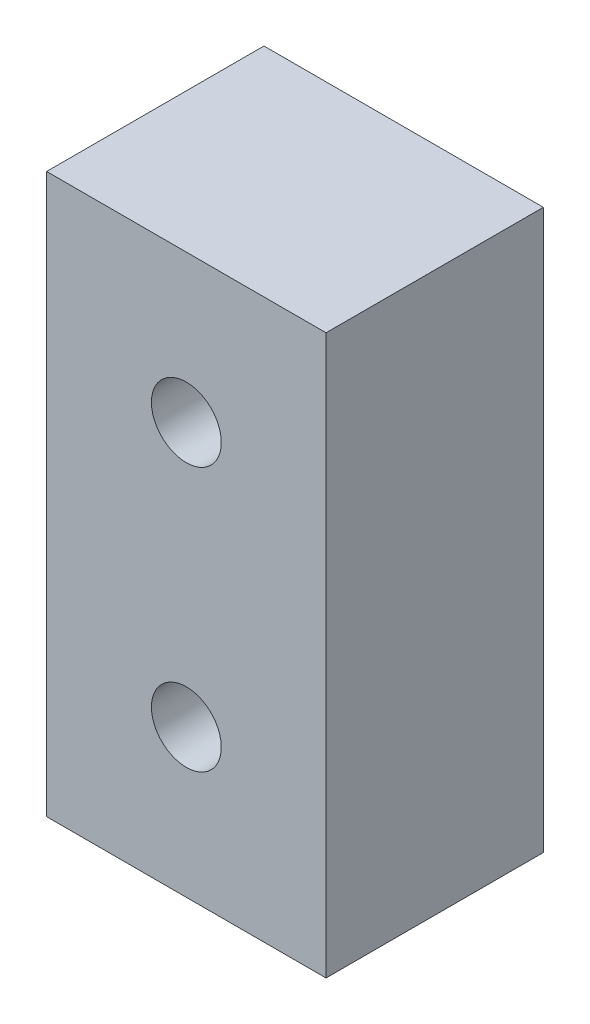
ISO-10303-21;
HEADER;
FILE_DESCRIPTION(('STEP AP214'),'2;1');
FILE_NAME('part.step','',(''),(''),'','','');
FILE_SCHEMA(('AUTOMOTIVE_DESIGN { 1 0 10303 214 1 1 1 1 }'));
ENDSEC;
DATA;
#1=APPLICATION_CONTEXT('core data for automotive mechanical design processes');
#2=APPLICATION_PROTOCOL_DEFINITION('international standard','automotive_design',2000,#1);
#3=PRODUCT_CONTEXT('',#1,'mechanical');
#4=PRODUCT('Part','Part','',(#3));
#5=PRODUCT_RELATED_PRODUCT_CATEGORY('part','',(#4));
#6=PRODUCT_DEFINITION_FORMATION('','',#4);
#7=PRODUCT_DEFINITION_CONTEXT('part definition',#1,'design');
#8=PRODUCT_DEFINITION('design','',#6,#7);
#9=PRODUCT_DEFINITION_SHAPE('','',#8);
#10=(LENGTH_UNIT() NAMED_UNIT(*) SI_UNIT(.MILLI.,.METRE.));
#11=(NAMED_UNIT(*) PLANE_ANGLE_UNIT() SI_UNIT($,.RADIAN.));
#12=(NAMED_UNIT(*) SI_UNIT($,.STERADIAN.) SOLID_ANGLE_UNIT());
#13=UNCERTAINTY_MEASURE_WITH_UNIT(LENGTH_MEASURE(1.E-05),#10,'distance_accuracy_value','');
#14=(GEOMETRIC_REPRESENTATION_CONTEXT(3) GLOBAL_UNCERTAINTY_ASSIGNED_CONTEXT((#13)) GLOBAL_UNIT_ASSIGNED_CONTEXT((#10,
#11,#12)) REPRESENTATION_CONTEXT('',''));
#15=CARTESIAN_POINT('',(0.,0.,0.));
#16=DIRECTION('',(0.,0.,1.));
#17=DIRECTION('',(1.,0.,0.));
#18=AXIS2_PLACEMENT_3D('',#15,#16,#17);
#19=CARTESIAN_POINT('',(-9.,-18.,7.));
#20=DIRECTION('',(1.,0.,0.));
#21=DIRECTION('',(0.,0.,-1.));
#22=AXIS2_PLACEMENT_3D('',#19,#20,#21);
#23=PLANE('',#22);
#24=DIRECTION('',(0.,-1.,0.));
#25=VECTOR('',#24,1.);
#26=CARTESIAN_POINT('',(-9.,-18.,-7.));
#27=LINE('',#26,#25);
#28=CARTESIAN_POINT('',(-9.,18.,-7.));
#29=VERTEX_POINT('',#28);
#30=CARTESIAN_POINT('',(-9.,-18.,-7.));
#31=VERTEX_POINT('',#30);
#32=EDGE_CURVE('E96',#29,#31,#27,.T.);
#33=ORIENTED_EDGE('',*,*,#32,.T.);
#34=DIRECTION('',(0.,0.,-1.));
#35=VECTOR('',#34,1.);
#36=CARTESIAN_POINT('',(-9.,-18.,7.));
#37=LINE('',#36,#35);
#38=CARTESIAN_POINT('',(-9.,-18.,7.));
#39=VERTEX_POINT('',#38);
#40=EDGE_CURVE('E11',#39,#31,#37,.T.);
#41=ORIENTED_EDGE('',*,*,#40,.F.);
#42=DIRECTION('',(0.,-1.,0.));
#43=VECTOR('',#42,1.);
#44=CARTESIAN_POINT('',(-9.,-18.,7.));
#45=LINE('',#44,#43);
#46=CARTESIAN_POINT('',(-9.,18.,7.));
#47=VERTEX_POINT('',#46);
#48=EDGE_CURVE('E84',#47,#39,#45,.T.);
#49=ORIENTED_EDGE('',*,*,#48,.F.);
#50=DIRECTION('',(0.,0.,-1.));
#51=VECTOR('',#50,1.);
#52=CARTESIAN_POINT('',(-9.,18.,7.));
#53=LINE('',#52,#51);
#54=EDGE_CURVE('E92',#47,#29,#53,.T.);
#55=ORIENTED_EDGE('',*,*,#54,.T.);
#56=EDGE_LOOP('',(#33,#41,#49,#55));
#57=FACE_BOUND('',#56,.T.);
#58=ADVANCED_FACE('F33',(#57),#23,.F.);
#59=CARTESIAN_POINT('',(9.,-18.,7.));
#60=DIRECTION('',(0.,1.,0.));
#61=DIRECTION('',(0.,0.,1.));
#62=AXIS2_PLACEMENT_3D('',#59,#60,#61);
#63=PLANE('',#62);
#64=DIRECTION('',(1.,0.,0.));
#65=VECTOR('',#64,1.);
#66=CARTESIAN_POINT('',(9.,-18.,-7.));
#67=LINE('',#66,#65);
#68=CARTESIAN_POINT('',(9.,-18.,-7.));
#69=VERTEX_POINT('',#68);
#70=EDGE_CURVE('E88',#31,#69,#67,.T.);
#71=ORIENTED_EDGE('',*,*,#70,.T.);
#72=DIRECTION('',(0.,0.,-1.));
#73=VECTOR('',#72,1.);
#74=CARTESIAN_POINT('',(9.,-18.,7.));
#75=LINE('',#74,#73);
#76=CARTESIAN_POINT('',(9.,-18.,7.));
#77=VERTEX_POINT('',#76);
#78=EDGE_CURVE('E41',#77,#69,#75,.T.);
#79=ORIENTED_EDGE('',*,*,#78,.F.);
#80=DIRECTION('',(1.,0.,0.));
#81=VECTOR('',#80,1.);
#82=CARTESIAN_POINT('',(9.,-18.,7.));
#83=LINE('',#82,#81);
#84=EDGE_CURVE('E79',#39,#77,#83,.T.);
#85=ORIENTED_EDGE('',*,*,#84,.F.);
#86=ORIENTED_EDGE('',*,*,#40,.T.);
#87=EDGE_LOOP('',(#71,#79,#85,#86));
#88=FACE_BOUND('',#87,.T.);
#89=ADVANCED_FACE('F87',(#88),#63,.F.);
#90=CARTESIAN_POINT('',(9.,-18.,7.));
#91=DIRECTION('',(-1.,0.,0.));
#92=DIRECTION('',(0.,0.,1.));
#93=AXIS2_PLACEMENT_3D('',#90,#91,#92);
#94=PLANE('',#93);
#95=DIRECTION('',(0.,1.,0.));
#96=VECTOR('',#95,1.);
#97=CARTESIAN_POINT('',(9.,-18.,-7.));
#98=LINE('',#97,#96);
#99=CARTESIAN_POINT('',(9.,18.,-7.));
#100=VERTEX_POINT('',#99);
#101=EDGE_CURVE('E66',#69,#100,#98,.T.);
#102=ORIENTED_EDGE('',*,*,#101,.T.);
#103=DIRECTION('',(0.,0.,-1.));
#104=VECTOR('',#103,1.);
#105=CARTESIAN_POINT('',(9.,18.,7.));
#106=LINE('',#105,#104);
#107=CARTESIAN_POINT('',(9.,18.,7.));
#108=VERTEX_POINT('',#107);
#109=EDGE_CURVE('E89',#108,#100,#106,.T.);
#110=ORIENTED_EDGE('',*,*,#109,.F.);
#111=DIRECTION('',(0.,1.,0.));
#112=VECTOR('',#111,1.);
#113=CARTESIAN_POINT('',(9.,-18.,7.));
#114=LINE('',#113,#112);
#115=EDGE_CURVE('E82',#77,#108,#114,.T.);
#116=ORIENTED_EDGE('',*,*,#115,.F.);
#117=ORIENTED_EDGE('',*,*,#78,.T.);
#118=EDGE_LOOP('',(#102,#110,#116,#117));
#119=FACE_BOUND('',#118,.T.);
#120=ADVANCED_FACE('F90',(#119),#94,.F.);
#121=CARTESIAN_POINT('',(9.,18.,7.));
#122=DIRECTION('',(0.,-1.,0.));
#123=DIRECTION('',(0.,0.,-1.));
#124=AXIS2_PLACEMENT_3D('',#121,#122,#123);
#125=PLANE('',#124);
#126=DIRECTION('',(-1.,0.,0.));
#127=VECTOR('',#126,1.);
#128=CARTESIAN_POINT('',(9.,18.,-7.));
#129=LINE('',#128,#127);
#130=EDGE_CURVE('E72',#100,#29,#129,.T.);
#131=ORIENTED_EDGE('',*,*,#130,.T.);
#132=ORIENTED_EDGE('',*,*,#54,.F.);
#133=DIRECTION('',(-1.,0.,0.));
#134=VECTOR('',#133,1.);
#135=CARTESIAN_POINT('',(9.,18.,7.));
#136=LINE('',#135,#134);
#137=EDGE_CURVE('E49',#108,#47,#136,.T.);
#138=ORIENTED_EDGE('',*,*,#137,.F.);
#139=ORIENTED_EDGE('',*,*,#109,.T.);
#140=EDGE_LOOP('',(#131,#132,#138,#139));
#141=FACE_BOUND('',#140,.T.);
#142=ADVANCED_FACE('F104',(#141),#125,.F.);
#143=CARTESIAN_POINT('',(0.,0.,7.));
#144=DIRECTION('',(0.,0.,1.));
#145=DIRECTION('',(1.,0.,0.));
#146=AXIS2_PLACEMENT_3D('',#143,#144,#145);
#147=PLANE('',#146);
#148=CARTESIAN_POINT('',(0.,8.5,7.));
#149=DIRECTION('',(0.,0.,-1.));
#150=DIRECTION('',(-1.,0.,0.));
#151=AXIS2_PLACEMENT_3D('',#148,#149,#150);
#152=CIRCLE('',#151,2.25);
#153=CARTESIAN_POINT('',(-2.25,8.5,7.));
#154=VERTEX_POINT('',#153);
#155=EDGE_CURVE('E121',#154,#154,#152,.T.);
#156=ORIENTED_EDGE('',*,*,#155,.T.);
#157=EDGE_LOOP('',(#156));
#158=FACE_BOUND('',#157,.T.);
#159=CARTESIAN_POINT('',(0.,-8.5,7.));
#160=DIRECTION('',(0.,0.,-1.));
#161=DIRECTION('',(-1.,0.,0.));
#162=AXIS2_PLACEMENT_3D('',#159,#160,#161);
#163=CIRCLE('',#162,2.25);
#164=CARTESIAN_POINT('',(-2.25,-8.5,7.));
#165=VERTEX_POINT('',#164);
#166=EDGE_CURVE('E99',#165,#165,#163,.T.);
#167=ORIENTED_EDGE('',*,*,#166,.T.);
#168=EDGE_LOOP('',(#167));
#169=FACE_BOUND('',#168,.T.);
#170=ORIENTED_EDGE('',*,*,#48,.T.);
#171=ORIENTED_EDGE('',*,*,#84,.T.);
#172=ORIENTED_EDGE('',*,*,#115,.T.);
#173=ORIENTED_EDGE('',*,*,#137,.T.);
#174=EDGE_LOOP('',(#170,#171,#172,#173));
#175=FACE_BOUND('',#174,.T.);
#176=ADVANCED_FACE('F80',(#158,#169,#175),#147,.T.);
#177=CARTESIAN_POINT('',(0.,0.,-7.));
#178=DIRECTION('',(0.,0.,1.));
#179=DIRECTION('',(1.,0.,0.));
#180=AXIS2_PLACEMENT_3D('',#177,#178,#179);
#181=PLANE('',#180);
#182=CARTESIAN_POINT('',(0.,8.5,-7.));
#183=DIRECTION('',(0.,0.,-1.));
#184=DIRECTION('',(-1.,0.,0.));
#185=AXIS2_PLACEMENT_3D('',#182,#183,#184);
#186=CIRCLE('',#185,3.99999999999999);
#187=CARTESIAN_POINT('',(-3.99999999999999,8.5,-7.));
#188=VERTEX_POINT('',#187);
#189=EDGE_CURVE('E130',#188,#188,#186,.T.);
#190=ORIENTED_EDGE('',*,*,#189,.F.);
#191=EDGE_LOOP('',(#190));
#192=FACE_BOUND('',#191,.T.);
#193=CARTESIAN_POINT('',(0.,-8.5,-7.));
#194=DIRECTION('',(0.,0.,-1.));
#195=DIRECTION('',(-1.,0.,0.));
#196=AXIS2_PLACEMENT_3D('',#193,#194,#195);
#197=CIRCLE('',#196,3.99999999999999);
#198=CARTESIAN_POINT('',(-3.99999999999999,-8.5,-7.));
#199=VERTEX_POINT('',#198);
#200=EDGE_CURVE('E118',#199,#199,#197,.T.);
#201=ORIENTED_EDGE('',*,*,#200,.F.);
#202=EDGE_LOOP('',(#201));
#203=FACE_BOUND('',#202,.T.);
#204=ORIENTED_EDGE('',*,*,#32,.F.);
#205=ORIENTED_EDGE('',*,*,#130,.F.);
#206=ORIENTED_EDGE('',*,*,#101,.F.);
#207=ORIENTED_EDGE('',*,*,#70,.F.);
#208=EDGE_LOOP('',(#204,#205,#206,#207));
#209=FACE_BOUND('',#208,.T.);
#210=ADVANCED_FACE('F107',(#192,#203,#209),#181,.F.);
#211=CARTESIAN_POINT('',(0.,-8.5,-7.));
#212=DIRECTION('',(0.,0.,-1.));
#213=DIRECTION('',(-1.,0.,0.));
#214=AXIS2_PLACEMENT_3D('',#211,#212,#213);
#215=CYLINDRICAL_SURFACE('',#214,2.25);
#216=ORIENTED_EDGE('',*,*,#166,.F.);
#217=EDGE_LOOP('',(#216));
#218=FACE_BOUND('',#217,.T.);
#219=CARTESIAN_POINT('',(0.,-8.5,-2.6));
#220=DIRECTION('',(0.,0.,-1.));
#221=DIRECTION('',(-1.,0.,0.));
#222=AXIS2_PLACEMENT_3D('',#219,#220,#221);
#223=CIRCLE('',#222,2.25);
#224=CARTESIAN_POINT('',(-2.25,-8.5,-2.6));
#225=VERTEX_POINT('',#224);
#226=EDGE_CURVE('E112',#225,#225,#223,.T.);
#227=ORIENTED_EDGE('',*,*,#226,.T.);
#228=EDGE_LOOP('',(#227));
#229=FACE_BOUND('',#228,.T.);
#230=ADVANCED_FACE('F138',(#218,#229),#215,.F.);
#231=CARTESIAN_POINT('',(2.25,-8.5,-2.6));
#232=DIRECTION('',(0.,0.,1.));
#233=DIRECTION('',(1.,0.,0.));
#234=AXIS2_PLACEMENT_3D('',#231,#232,#233);
#235=PLANE('',#234);
#236=ORIENTED_EDGE('',*,*,#226,.F.);
#237=EDGE_LOOP('',(#236));
#238=FACE_BOUND('',#237,.T.);
#239=CARTESIAN_POINT('',(0.,-8.5,-2.6));
#240=DIRECTION('',(0.,0.,-1.));
#241=DIRECTION('',(-1.,0.,0.));
#242=AXIS2_PLACEMENT_3D('',#239,#240,#241);
#243=CIRCLE('',#242,4.);
#244=CARTESIAN_POINT('',(-4.,-8.5,-2.6));
#245=VERTEX_POINT('',#244);
#246=EDGE_CURVE('E115',#245,#245,#243,.T.);
#247=ORIENTED_EDGE('',*,*,#246,.T.);
#248=EDGE_LOOP('',(#247));
#249=FACE_BOUND('',#248,.T.);
#250=ADVANCED_FACE('F145',(#238,#249),#235,.F.);
#251=CARTESIAN_POINT('',(0.,-8.5,-7.));
#252=DIRECTION('',(0.,0.,-1.));
#253=DIRECTION('',(-1.,0.,0.));
#254=AXIS2_PLACEMENT_3D('',#251,#252,#253);
#255=CYLINDRICAL_SURFACE('',#254,3.99999999999999);
#256=ORIENTED_EDGE('',*,*,#246,.F.);
#257=EDGE_LOOP('',(#256));
#258=FACE_BOUND('',#257,.T.);
#259=ORIENTED_EDGE('',*,*,#200,.T.);
#260=EDGE_LOOP('',(#259));
#261=FACE_BOUND('',#260,.T.);
#262=ADVANCED_FACE('F142',(#258,#261),#255,.F.);
#263=CARTESIAN_POINT('',(0.,8.5,-7.));
#264=DIRECTION('',(0.,0.,-1.));
#265=DIRECTION('',(-1.,0.,0.));
#266=AXIS2_PLACEMENT_3D('',#263,#264,#265);
#267=CYLINDRICAL_SURFACE('',#266,2.25);
#268=ORIENTED_EDGE('',*,*,#155,.F.);
#269=EDGE_LOOP('',(#268));
#270=FACE_BOUND('',#269,.T.);
#271=CARTESIAN_POINT('',(0.,8.5,-2.6));
#272=DIRECTION('',(0.,0.,-1.));
#273=DIRECTION('',(-1.,0.,0.));
#274=AXIS2_PLACEMENT_3D('',#271,#272,#273);
#275=CIRCLE('',#274,2.25);
#276=CARTESIAN_POINT('',(-2.25,8.5,-2.6));
#277=VERTEX_POINT('',#276);
#278=EDGE_CURVE('E124',#277,#277,#275,.T.);
#279=ORIENTED_EDGE('',*,*,#278,.T.);
#280=EDGE_LOOP('',(#279));
#281=FACE_BOUND('',#280,.T.);
#282=ADVANCED_FACE('F144',(#270,#281),#267,.F.);
#283=CARTESIAN_POINT('',(2.25,8.5,-2.6));
#284=DIRECTION('',(0.,0.,1.));
#285=DIRECTION('',(1.,0.,0.));
#286=AXIS2_PLACEMENT_3D('',#283,#284,#285);
#287=PLANE('',#286);
#288=ORIENTED_EDGE('',*,*,#278,.F.);
#289=EDGE_LOOP('',(#288));
#290=FACE_BOUND('',#289,.T.);
#291=CARTESIAN_POINT('',(0.,8.5,-2.6));
#292=DIRECTION('',(0.,0.,-1.));
#293=DIRECTION('',(-1.,0.,0.));
#294=AXIS2_PLACEMENT_3D('',#291,#292,#293);
#295=CIRCLE('',#294,4.);
#296=CARTESIAN_POINT('',(-4.,8.5,-2.6));
#297=VERTEX_POINT('',#296);
#298=EDGE_CURVE('E127',#297,#297,#295,.T.);
#299=ORIENTED_EDGE('',*,*,#298,.T.);
#300=EDGE_LOOP('',(#299));
#301=FACE_BOUND('',#300,.T.);
#302=ADVANCED_FACE('F152',(#290,#301),#287,.F.);
#303=CARTESIAN_POINT('',(0.,8.5,-7.));
#304=DIRECTION('',(0.,0.,-1.));
#305=DIRECTION('',(-1.,0.,0.));
#306=AXIS2_PLACEMENT_3D('',#303,#304,#305);
#307=CYLINDRICAL_SURFACE('',#306,3.99999999999999);
#308=ORIENTED_EDGE('',*,*,#298,.F.);
#309=EDGE_LOOP('',(#308));
#310=FACE_BOUND('',#309,.T.);
#311=ORIENTED_EDGE('',*,*,#189,.T.);
#312=EDGE_LOOP('',(#311));
#313=FACE_BOUND('',#312,.T.);
#314=ADVANCED_FACE('F134',(#310,#313),#307,.F.);
#315=CLOSED_SHELL('',(#58,#89,#120,#142,#176,#210,#230,#250,#262,#282,#302,#314));
#316=MANIFOLD_SOLID_BREP('B2',#315);
#317=ADVANCED_BREP_SHAPE_REPRESENTATION('',(#18,#316),#14);
#318=SHAPE_DEFINITION_REPRESENTATION(#9,#317);
ENDSEC;
END-ISO-10303-21;
